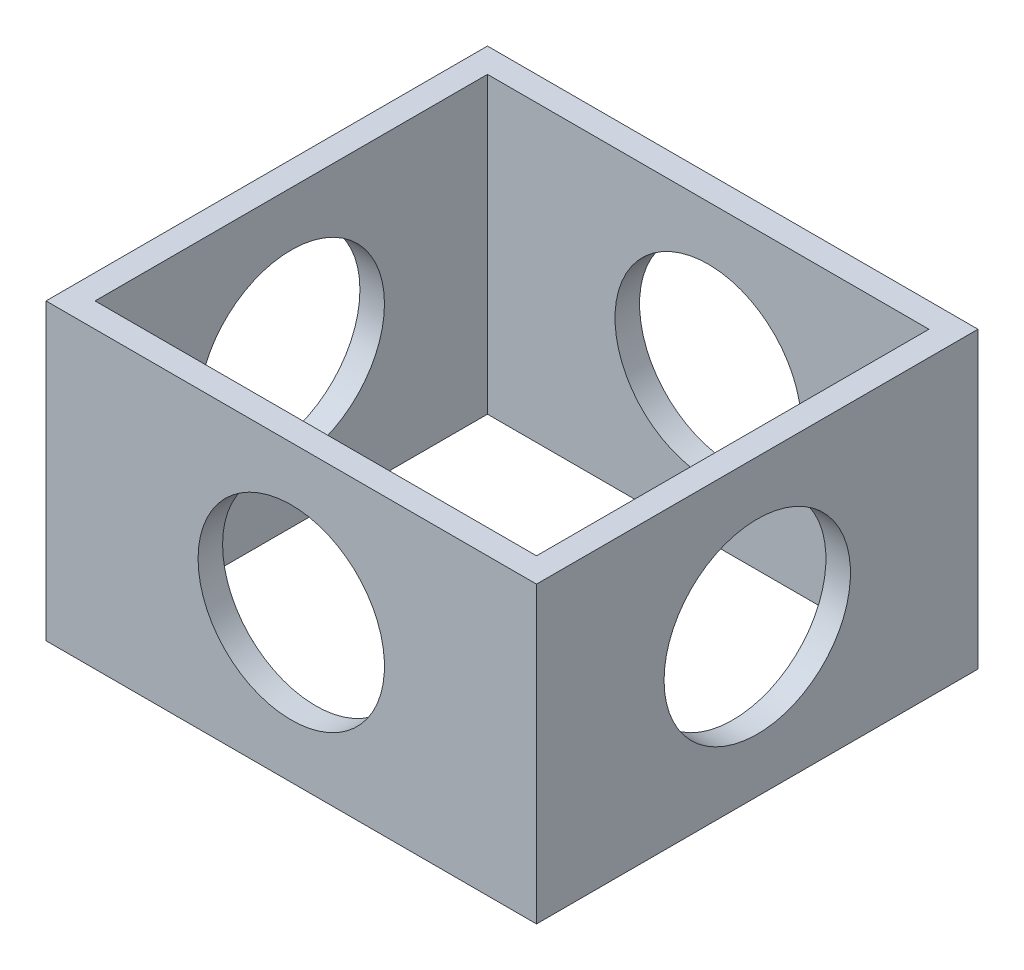
ISO-10303-21;
HEADER;
FILE_DESCRIPTION(('STEP AP214'),'2;1');
FILE_NAME('part.step','',(''),(''),'','','');
FILE_SCHEMA(('AUTOMOTIVE_DESIGN { 1 0 10303 214 1 1 1 1 }'));
ENDSEC;
DATA;
#1=APPLICATION_CONTEXT('core data for automotive mechanical design processes');
#2=APPLICATION_PROTOCOL_DEFINITION('international standard','automotive_design',2000,#1);
#3=PRODUCT_CONTEXT('',#1,'mechanical');
#4=PRODUCT('Part','Part','',(#3));
#5=PRODUCT_RELATED_PRODUCT_CATEGORY('part','',(#4));
#6=PRODUCT_DEFINITION_FORMATION('','',#4);
#7=PRODUCT_DEFINITION_CONTEXT('part definition',#1,'design');
#8=PRODUCT_DEFINITION('design','',#6,#7);
#9=PRODUCT_DEFINITION_SHAPE('','',#8);
#10=(LENGTH_UNIT() NAMED_UNIT(*) SI_UNIT(.MILLI.,.METRE.));
#11=(NAMED_UNIT(*) PLANE_ANGLE_UNIT() SI_UNIT($,.RADIAN.));
#12=(NAMED_UNIT(*) SI_UNIT($,.STERADIAN.) SOLID_ANGLE_UNIT());
#13=UNCERTAINTY_MEASURE_WITH_UNIT(LENGTH_MEASURE(1.E-05),#10,'distance_accuracy_value','');
#14=(GEOMETRIC_REPRESENTATION_CONTEXT(3) GLOBAL_UNCERTAINTY_ASSIGNED_CONTEXT((#13)) GLOBAL_UNIT_ASSIGNED_CONTEXT((#10,
#11,#12)) REPRESENTATION_CONTEXT('',''));
#15=CARTESIAN_POINT('',(0.,0.,0.));
#16=DIRECTION('',(0.,0.,1.));
#17=DIRECTION('',(1.,0.,0.));
#18=AXIS2_PLACEMENT_3D('',#15,#16,#17);
#19=CARTESIAN_POINT('',(0.,30.,0.));
#20=DIRECTION('',(0.,-1.,0.));
#21=DIRECTION('',(0.,0.,-1.));
#22=AXIS2_PLACEMENT_3D('',#19,#20,#21);
#23=PLANE('',#22);
#24=DIRECTION('',(0.,0.,-1.));
#25=VECTOR('',#24,1.);
#26=CARTESIAN_POINT('',(25.,30.,22.5));
#27=LINE('',#26,#25);
#28=CARTESIAN_POINT('',(25.,30.,22.5));
#29=VERTEX_POINT('',#28);
#30=CARTESIAN_POINT('',(25.,30.,-22.5));
#31=VERTEX_POINT('',#30);
#32=EDGE_CURVE('E163',#29,#31,#27,.T.);
#33=ORIENTED_EDGE('',*,*,#32,.T.);
#34=DIRECTION('',(-1.,0.,0.));
#35=VECTOR('',#34,1.);
#36=CARTESIAN_POINT('',(-25.,30.,-22.5));
#37=LINE('',#36,#35);
#38=CARTESIAN_POINT('',(-25.,30.,-22.5));
#39=VERTEX_POINT('',#38);
#40=EDGE_CURVE('E167',#31,#39,#37,.T.);
#41=ORIENTED_EDGE('',*,*,#40,.T.);
#42=DIRECTION('',(0.,0.,1.));
#43=VECTOR('',#42,1.);
#44=CARTESIAN_POINT('',(-25.,30.,22.5));
#45=LINE('',#44,#43);
#46=CARTESIAN_POINT('',(-25.,30.,22.5));
#47=VERTEX_POINT('',#46);
#48=EDGE_CURVE('E171',#39,#47,#45,.T.);
#49=ORIENTED_EDGE('',*,*,#48,.T.);
#50=DIRECTION('',(1.,0.,0.));
#51=VECTOR('',#50,1.);
#52=CARTESIAN_POINT('',(-25.,30.,22.5));
#53=LINE('',#52,#51);
#54=EDGE_CURVE('E174',#47,#29,#53,.T.);
#55=ORIENTED_EDGE('',*,*,#54,.T.);
#56=EDGE_LOOP('',(#33,#41,#49,#55));
#57=FACE_BOUND('',#56,.T.);
#58=DIRECTION('',(0.,0.,-1.));
#59=VECTOR('',#58,1.);
#60=CARTESIAN_POINT('',(22.5,30.,20.));
#61=LINE('',#60,#59);
#62=CARTESIAN_POINT('',(22.5,30.,20.));
#63=VERTEX_POINT('',#62);
#64=CARTESIAN_POINT('',(22.5,30.,-20.));
#65=VERTEX_POINT('',#64);
#66=EDGE_CURVE('E113',#63,#65,#61,.T.);
#67=ORIENTED_EDGE('',*,*,#66,.F.);
#68=DIRECTION('',(1.,0.,0.));
#69=VECTOR('',#68,1.);
#70=CARTESIAN_POINT('',(-22.5,30.,20.));
#71=LINE('',#70,#69);
#72=CARTESIAN_POINT('',(-22.5,30.,20.));
#73=VERTEX_POINT('',#72);
#74=EDGE_CURVE('E139',#73,#63,#71,.T.);
#75=ORIENTED_EDGE('',*,*,#74,.F.);
#76=DIRECTION('',(0.,0.,1.));
#77=VECTOR('',#76,1.);
#78=CARTESIAN_POINT('',(-22.5,30.,20.));
#79=LINE('',#78,#77);
#80=CARTESIAN_POINT('',(-22.5,30.,-20.));
#81=VERTEX_POINT('',#80);
#82=EDGE_CURVE('E135',#81,#73,#79,.T.);
#83=ORIENTED_EDGE('',*,*,#82,.F.);
#84=DIRECTION('',(-1.,0.,0.));
#85=VECTOR('',#84,1.);
#86=CARTESIAN_POINT('',(-22.5,30.,-20.));
#87=LINE('',#86,#85);
#88=EDGE_CURVE('E122',#65,#81,#87,.T.);
#89=ORIENTED_EDGE('',*,*,#88,.F.);
#90=EDGE_LOOP('',(#67,#75,#83,#89));
#91=FACE_BOUND('',#90,.T.);
#92=ADVANCED_FACE('F45',(#57,#91),#23,.F.);
#93=CARTESIAN_POINT('',(0.,0.,0.));
#94=DIRECTION('',(0.,-1.,0.));
#95=DIRECTION('',(0.,0.,-1.));
#96=AXIS2_PLACEMENT_3D('',#93,#94,#95);
#97=PLANE('',#96);
#98=DIRECTION('',(0.,0.,-1.));
#99=VECTOR('',#98,1.);
#100=CARTESIAN_POINT('',(25.,0.,22.5));
#101=LINE('',#100,#99);
#102=CARTESIAN_POINT('',(25.,0.,22.5));
#103=VERTEX_POINT('',#102);
#104=CARTESIAN_POINT('',(25.,0.,-22.5));
#105=VERTEX_POINT('',#104);
#106=EDGE_CURVE('E131',#103,#105,#101,.T.);
#107=ORIENTED_EDGE('',*,*,#106,.F.);
#108=DIRECTION('',(1.,0.,0.));
#109=VECTOR('',#108,1.);
#110=CARTESIAN_POINT('',(-25.,0.,22.5));
#111=LINE('',#110,#109);
#112=CARTESIAN_POINT('',(-25.,0.,22.5));
#113=VERTEX_POINT('',#112);
#114=EDGE_CURVE('E168',#113,#103,#111,.T.);
#115=ORIENTED_EDGE('',*,*,#114,.F.);
#116=DIRECTION('',(0.,0.,1.));
#117=VECTOR('',#116,1.);
#118=CARTESIAN_POINT('',(-25.,0.,22.5));
#119=LINE('',#118,#117);
#120=CARTESIAN_POINT('',(-25.,0.,-22.5));
#121=VERTEX_POINT('',#120);
#122=EDGE_CURVE('E184',#121,#113,#119,.T.);
#123=ORIENTED_EDGE('',*,*,#122,.F.);
#124=DIRECTION('',(-1.,0.,0.));
#125=VECTOR('',#124,1.);
#126=CARTESIAN_POINT('',(-25.,0.,-22.5));
#127=LINE('',#126,#125);
#128=EDGE_CURVE('E181',#105,#121,#127,.T.);
#129=ORIENTED_EDGE('',*,*,#128,.F.);
#130=EDGE_LOOP('',(#107,#115,#123,#129));
#131=FACE_BOUND('',#130,.T.);
#132=DIRECTION('',(1.,0.,0.));
#133=VECTOR('',#132,1.);
#134=CARTESIAN_POINT('',(-22.5,0.,20.));
#135=LINE('',#134,#133);
#136=CARTESIAN_POINT('',(-22.5,0.,20.));
#137=VERTEX_POINT('',#136);
#138=CARTESIAN_POINT('',(22.5,0.,20.));
#139=VERTEX_POINT('',#138);
#140=EDGE_CURVE('E123',#137,#139,#135,.T.);
#141=ORIENTED_EDGE('',*,*,#140,.T.);
#142=DIRECTION('',(0.,0.,-1.));
#143=VECTOR('',#142,1.);
#144=CARTESIAN_POINT('',(22.5,0.,20.));
#145=LINE('',#144,#143);
#146=CARTESIAN_POINT('',(22.5,0.,-20.));
#147=VERTEX_POINT('',#146);
#148=EDGE_CURVE('E71',#139,#147,#145,.T.);
#149=ORIENTED_EDGE('',*,*,#148,.T.);
#150=DIRECTION('',(-1.,0.,0.));
#151=VECTOR('',#150,1.);
#152=CARTESIAN_POINT('',(-22.5,0.,-20.));
#153=LINE('',#152,#151);
#154=CARTESIAN_POINT('',(-22.5,0.,-20.));
#155=VERTEX_POINT('',#154);
#156=EDGE_CURVE('E129',#147,#155,#153,.T.);
#157=ORIENTED_EDGE('',*,*,#156,.T.);
#158=DIRECTION('',(0.,0.,1.));
#159=VECTOR('',#158,1.);
#160=CARTESIAN_POINT('',(-22.5,0.,20.));
#161=LINE('',#160,#159);
#162=EDGE_CURVE('E150',#155,#137,#161,.T.);
#163=ORIENTED_EDGE('',*,*,#162,.T.);
#164=EDGE_LOOP('',(#141,#149,#157,#163));
#165=FACE_BOUND('',#164,.T.);
#166=ADVANCED_FACE('F242',(#131,#165),#97,.T.);
#167=CARTESIAN_POINT('',(25.,30.,22.5));
#168=DIRECTION('',(-1.,0.,0.));
#169=DIRECTION('',(0.,0.,1.));
#170=AXIS2_PLACEMENT_3D('',#167,#168,#169);
#171=PLANE('',#170);
#172=CARTESIAN_POINT('',(25.,15.,0.));
#173=DIRECTION('',(-1.,0.,0.));
#174=DIRECTION('',(0.,0.,1.));
#175=AXIS2_PLACEMENT_3D('',#172,#173,#174);
#176=CIRCLE('',#175,9.5);
#177=CARTESIAN_POINT('',(25.,15.,9.49999999999999));
#178=VERTEX_POINT('',#177);
#179=EDGE_CURVE('E293',#178,#178,#176,.T.);
#180=ORIENTED_EDGE('',*,*,#179,.T.);
#181=EDGE_LOOP('',(#180));
#182=FACE_BOUND('',#181,.T.);
#183=ORIENTED_EDGE('',*,*,#106,.T.);
#184=DIRECTION('',(0.,-1.,0.));
#185=VECTOR('',#184,1.);
#186=CARTESIAN_POINT('',(25.,30.,-22.5));
#187=LINE('',#186,#185);
#188=EDGE_CURVE('E11',#31,#105,#187,.T.);
#189=ORIENTED_EDGE('',*,*,#188,.F.);
#190=ORIENTED_EDGE('',*,*,#32,.F.);
#191=DIRECTION('',(0.,-1.,0.));
#192=VECTOR('',#191,1.);
#193=CARTESIAN_POINT('',(25.,30.,22.5));
#194=LINE('',#193,#192);
#195=EDGE_CURVE('E177',#29,#103,#194,.T.);
#196=ORIENTED_EDGE('',*,*,#195,.T.);
#197=EDGE_LOOP('',(#183,#189,#190,#196));
#198=FACE_BOUND('',#197,.T.);
#199=ADVANCED_FACE('F47',(#182,#198),#171,.F.);
#200=CARTESIAN_POINT('',(-25.,30.,-22.5));
#201=DIRECTION('',(0.,0.,1.));
#202=DIRECTION('',(1.,0.,0.));
#203=AXIS2_PLACEMENT_3D('',#200,#201,#202);
#204=PLANE('',#203);
#205=CARTESIAN_POINT('',(0.,15.,-22.5));
#206=DIRECTION('',(0.,0.,1.));
#207=DIRECTION('',(1.,0.,0.));
#208=AXIS2_PLACEMENT_3D('',#205,#206,#207);
#209=CIRCLE('',#208,9.5);
#210=CARTESIAN_POINT('',(9.5,15.,-22.5));
#211=VERTEX_POINT('',#210);
#212=EDGE_CURVE('E202',#211,#211,#209,.T.);
#213=ORIENTED_EDGE('',*,*,#212,.T.);
#214=EDGE_LOOP('',(#213));
#215=FACE_BOUND('',#214,.T.);
#216=ORIENTED_EDGE('',*,*,#128,.T.);
#217=DIRECTION('',(0.,-1.,0.));
#218=VECTOR('',#217,1.);
#219=CARTESIAN_POINT('',(-25.,30.,-22.5));
#220=LINE('',#219,#218);
#221=EDGE_CURVE('E55',#39,#121,#220,.T.);
#222=ORIENTED_EDGE('',*,*,#221,.F.);
#223=ORIENTED_EDGE('',*,*,#40,.F.);
#224=ORIENTED_EDGE('',*,*,#188,.T.);
#225=EDGE_LOOP('',(#216,#222,#223,#224));
#226=FACE_BOUND('',#225,.T.);
#227=ADVANCED_FACE('F257',(#215,#226),#204,.F.);
#228=CARTESIAN_POINT('',(-25.,30.,22.5));
#229=DIRECTION('',(1.,0.,0.));
#230=DIRECTION('',(0.,0.,-1.));
#231=AXIS2_PLACEMENT_3D('',#228,#229,#230);
#232=PLANE('',#231);
#233=CARTESIAN_POINT('',(-25.,15.,0.));
#234=DIRECTION('',(1.,0.,0.));
#235=DIRECTION('',(0.,0.,-1.));
#236=AXIS2_PLACEMENT_3D('',#233,#234,#235);
#237=CIRCLE('',#236,9.5);
#238=CARTESIAN_POINT('',(-25.,15.,-9.50000000000001));
#239=VERTEX_POINT('',#238);
#240=EDGE_CURVE('E210',#239,#239,#237,.T.);
#241=ORIENTED_EDGE('',*,*,#240,.T.);
#242=EDGE_LOOP('',(#241));
#243=FACE_BOUND('',#242,.T.);
#244=ORIENTED_EDGE('',*,*,#122,.T.);
#245=DIRECTION('',(0.,-1.,0.));
#246=VECTOR('',#245,1.);
#247=CARTESIAN_POINT('',(-25.,30.,22.5));
#248=LINE('',#247,#246);
#249=EDGE_CURVE('E192',#47,#113,#248,.T.);
#250=ORIENTED_EDGE('',*,*,#249,.F.);
#251=ORIENTED_EDGE('',*,*,#48,.F.);
#252=ORIENTED_EDGE('',*,*,#221,.T.);
#253=EDGE_LOOP('',(#244,#250,#251,#252));
#254=FACE_BOUND('',#253,.T.);
#255=ADVANCED_FACE('F255',(#243,#254),#232,.F.);
#256=CARTESIAN_POINT('',(-25.,30.,22.5));
#257=DIRECTION('',(0.,0.,-1.));
#258=DIRECTION('',(-1.,0.,0.));
#259=AXIS2_PLACEMENT_3D('',#256,#257,#258);
#260=PLANE('',#259);
#261=CARTESIAN_POINT('',(0.,15.,22.5));
#262=DIRECTION('',(0.,0.,-1.));
#263=DIRECTION('',(-1.,0.,0.));
#264=AXIS2_PLACEMENT_3D('',#261,#262,#263);
#265=CIRCLE('',#264,9.5);
#266=CARTESIAN_POINT('',(-9.5,15.,22.5));
#267=VERTEX_POINT('',#266);
#268=EDGE_CURVE('E147',#267,#267,#265,.T.);
#269=ORIENTED_EDGE('',*,*,#268,.T.);
#270=EDGE_LOOP('',(#269));
#271=FACE_BOUND('',#270,.T.);
#272=ORIENTED_EDGE('',*,*,#114,.T.);
#273=ORIENTED_EDGE('',*,*,#195,.F.);
#274=ORIENTED_EDGE('',*,*,#54,.F.);
#275=ORIENTED_EDGE('',*,*,#249,.T.);
#276=EDGE_LOOP('',(#272,#273,#274,#275));
#277=FACE_BOUND('',#276,.T.);
#278=ADVANCED_FACE('F223',(#271,#277),#260,.F.);
#279=CARTESIAN_POINT('',(22.5,30.,20.));
#280=DIRECTION('',(-1.,0.,0.));
#281=DIRECTION('',(0.,0.,1.));
#282=AXIS2_PLACEMENT_3D('',#279,#280,#281);
#283=PLANE('',#282);
#284=CARTESIAN_POINT('',(22.5,15.,0.));
#285=DIRECTION('',(-1.,0.,0.));
#286=DIRECTION('',(0.,0.,1.));
#287=AXIS2_PLACEMENT_3D('',#284,#285,#286);
#288=CIRCLE('',#287,9.5);
#289=CARTESIAN_POINT('',(22.5,15.,9.49999999999999));
#290=VERTEX_POINT('',#289);
#291=EDGE_CURVE('E216',#290,#290,#288,.T.);
#292=ORIENTED_EDGE('',*,*,#291,.F.);
#293=EDGE_LOOP('',(#292));
#294=FACE_BOUND('',#293,.T.);
#295=ORIENTED_EDGE('',*,*,#148,.F.);
#296=DIRECTION('',(0.,-1.,0.));
#297=VECTOR('',#296,1.);
#298=CARTESIAN_POINT('',(22.5,30.,20.));
#299=LINE('',#298,#297);
#300=EDGE_CURVE('E117',#63,#139,#299,.T.);
#301=ORIENTED_EDGE('',*,*,#300,.F.);
#302=ORIENTED_EDGE('',*,*,#66,.T.);
#303=DIRECTION('',(0.,-1.,0.));
#304=VECTOR('',#303,1.);
#305=CARTESIAN_POINT('',(22.5,30.,-20.));
#306=LINE('',#305,#304);
#307=EDGE_CURVE('E116',#65,#147,#306,.T.);
#308=ORIENTED_EDGE('',*,*,#307,.T.);
#309=EDGE_LOOP('',(#295,#301,#302,#308));
#310=FACE_BOUND('',#309,.T.);
#311=ADVANCED_FACE('F115',(#294,#310),#283,.T.);
#312=CARTESIAN_POINT('',(-22.5,30.,-20.));
#313=DIRECTION('',(0.,0.,1.));
#314=DIRECTION('',(1.,0.,0.));
#315=AXIS2_PLACEMENT_3D('',#312,#313,#314);
#316=PLANE('',#315);
#317=CARTESIAN_POINT('',(0.,15.,-20.));
#318=DIRECTION('',(0.,0.,1.));
#319=DIRECTION('',(1.,0.,0.));
#320=AXIS2_PLACEMENT_3D('',#317,#318,#319);
#321=CIRCLE('',#320,9.5);
#322=CARTESIAN_POINT('',(9.5,15.,-20.));
#323=VERTEX_POINT('',#322);
#324=EDGE_CURVE('E201',#323,#323,#321,.T.);
#325=ORIENTED_EDGE('',*,*,#324,.F.);
#326=EDGE_LOOP('',(#325));
#327=FACE_BOUND('',#326,.T.);
#328=ORIENTED_EDGE('',*,*,#156,.F.);
#329=ORIENTED_EDGE('',*,*,#307,.F.);
#330=ORIENTED_EDGE('',*,*,#88,.T.);
#331=DIRECTION('',(0.,-1.,0.));
#332=VECTOR('',#331,1.);
#333=CARTESIAN_POINT('',(-22.5,30.,-20.));
#334=LINE('',#333,#332);
#335=EDGE_CURVE('E132',#81,#155,#334,.T.);
#336=ORIENTED_EDGE('',*,*,#335,.T.);
#337=EDGE_LOOP('',(#328,#329,#330,#336));
#338=FACE_BOUND('',#337,.T.);
#339=ADVANCED_FACE('F126',(#327,#338),#316,.T.);
#340=CARTESIAN_POINT('',(-22.5,30.,20.));
#341=DIRECTION('',(1.,0.,0.));
#342=DIRECTION('',(0.,0.,-1.));
#343=AXIS2_PLACEMENT_3D('',#340,#341,#342);
#344=PLANE('',#343);
#345=CARTESIAN_POINT('',(-22.5,15.,0.));
#346=DIRECTION('',(1.,0.,0.));
#347=DIRECTION('',(0.,0.,-1.));
#348=AXIS2_PLACEMENT_3D('',#345,#346,#347);
#349=CIRCLE('',#348,9.5);
#350=CARTESIAN_POINT('',(-22.5,15.,-9.50000000000001));
#351=VERTEX_POINT('',#350);
#352=EDGE_CURVE('E49',#351,#351,#349,.T.);
#353=ORIENTED_EDGE('',*,*,#352,.F.);
#354=EDGE_LOOP('',(#353));
#355=FACE_BOUND('',#354,.T.);
#356=ORIENTED_EDGE('',*,*,#162,.F.);
#357=ORIENTED_EDGE('',*,*,#335,.F.);
#358=ORIENTED_EDGE('',*,*,#82,.T.);
#359=DIRECTION('',(0.,-1.,0.));
#360=VECTOR('',#359,1.);
#361=CARTESIAN_POINT('',(-22.5,30.,20.));
#362=LINE('',#361,#360);
#363=EDGE_CURVE('E63',#73,#137,#362,.T.);
#364=ORIENTED_EDGE('',*,*,#363,.T.);
#365=EDGE_LOOP('',(#356,#357,#358,#364));
#366=FACE_BOUND('',#365,.T.);
#367=ADVANCED_FACE('F237',(#355,#366),#344,.T.);
#368=CARTESIAN_POINT('',(-22.5,30.,20.));
#369=DIRECTION('',(0.,0.,-1.));
#370=DIRECTION('',(-1.,0.,0.));
#371=AXIS2_PLACEMENT_3D('',#368,#369,#370);
#372=PLANE('',#371);
#373=CARTESIAN_POINT('',(0.,15.,20.));
#374=DIRECTION('',(0.,0.,-1.));
#375=DIRECTION('',(-1.,0.,0.));
#376=AXIS2_PLACEMENT_3D('',#373,#374,#375);
#377=CIRCLE('',#376,9.5);
#378=CARTESIAN_POINT('',(-9.5,15.,20.));
#379=VERTEX_POINT('',#378);
#380=EDGE_CURVE('E198',#379,#379,#377,.T.);
#381=ORIENTED_EDGE('',*,*,#380,.F.);
#382=EDGE_LOOP('',(#381));
#383=FACE_BOUND('',#382,.T.);
#384=ORIENTED_EDGE('',*,*,#140,.F.);
#385=ORIENTED_EDGE('',*,*,#363,.F.);
#386=ORIENTED_EDGE('',*,*,#74,.T.);
#387=ORIENTED_EDGE('',*,*,#300,.T.);
#388=EDGE_LOOP('',(#384,#385,#386,#387));
#389=FACE_BOUND('',#388,.T.);
#390=ADVANCED_FACE('F229',(#383,#389),#372,.T.);
#391=CARTESIAN_POINT('',(0.,15.,-22.5));
#392=DIRECTION('',(0.,0.,1.));
#393=DIRECTION('',(1.,0.,0.));
#394=AXIS2_PLACEMENT_3D('',#391,#392,#393);
#395=CYLINDRICAL_SURFACE('',#394,9.5);
#396=ORIENTED_EDGE('',*,*,#380,.T.);
#397=EDGE_LOOP('',(#396));
#398=FACE_BOUND('',#397,.T.);
#399=ORIENTED_EDGE('',*,*,#268,.F.);
#400=EDGE_LOOP('',(#399));
#401=FACE_BOUND('',#400,.T.);
#402=ADVANCED_FACE('F226',(#398,#401),#395,.F.);
#403=ORIENTED_EDGE('',*,*,#324,.T.);
#404=EDGE_LOOP('',(#403));
#405=FACE_BOUND('',#404,.T.);
#406=ORIENTED_EDGE('',*,*,#212,.F.);
#407=EDGE_LOOP('',(#406));
#408=FACE_BOUND('',#407,.T.);
#409=ADVANCED_FACE('F228',(#405,#408),#395,.F.);
#410=CARTESIAN_POINT('',(25.,15.,0.));
#411=DIRECTION('',(-1.,0.,0.));
#412=DIRECTION('',(0.,0.,1.));
#413=AXIS2_PLACEMENT_3D('',#410,#411,#412);
#414=CYLINDRICAL_SURFACE('',#413,9.5);
#415=ORIENTED_EDGE('',*,*,#352,.T.);
#416=EDGE_LOOP('',(#415));
#417=FACE_BOUND('',#416,.T.);
#418=ORIENTED_EDGE('',*,*,#240,.F.);
#419=EDGE_LOOP('',(#418));
#420=FACE_BOUND('',#419,.T.);
#421=ADVANCED_FACE('F235',(#417,#420),#414,.F.);
#422=ORIENTED_EDGE('',*,*,#291,.T.);
#423=EDGE_LOOP('',(#422));
#424=FACE_BOUND('',#423,.T.);
#425=ORIENTED_EDGE('',*,*,#179,.F.);
#426=EDGE_LOOP('',(#425));
#427=FACE_BOUND('',#426,.T.);
#428=ADVANCED_FACE('F301',(#424,#427),#414,.F.);
#429=CLOSED_SHELL('',(#92,#166,#199,#227,#255,#278,#311,#339,#367,#390,#402,#409,#421,#428));
#430=MANIFOLD_SOLID_BREP('B2',#429);
#431=ADVANCED_BREP_SHAPE_REPRESENTATION('',(#18,#430),#14);
#432=SHAPE_DEFINITION_REPRESENTATION(#9,#431);
ENDSEC;
END-ISO-10303-21;
